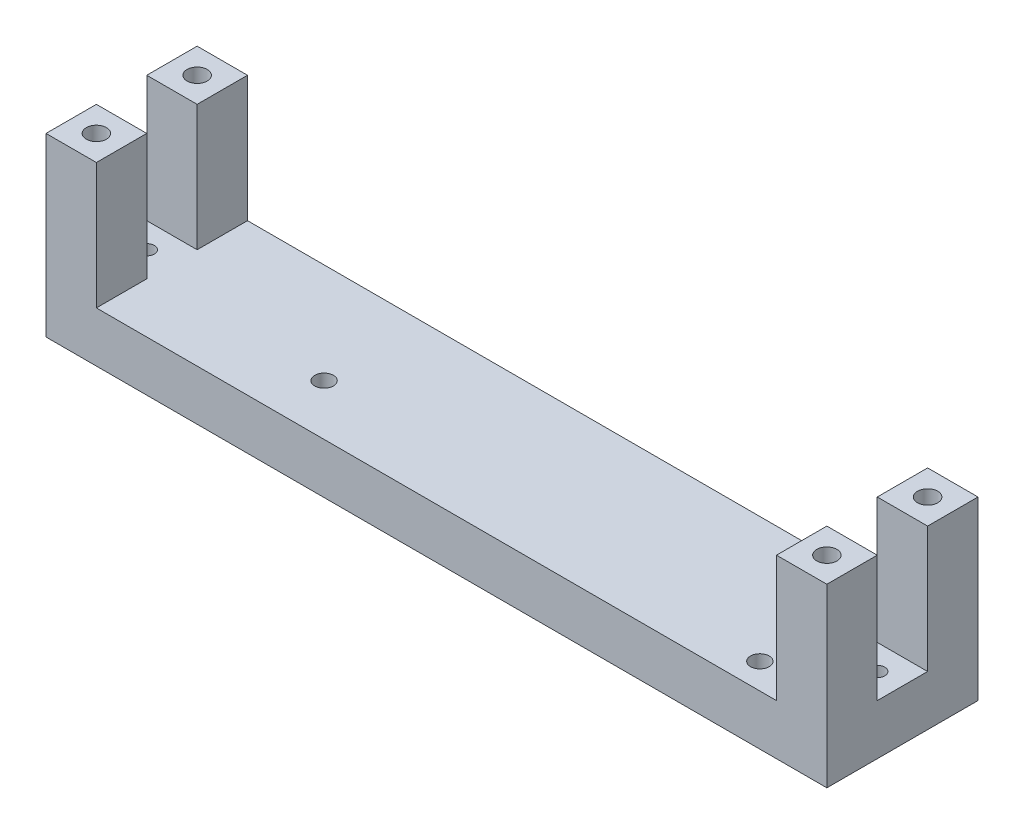
ISO-10303-21;
HEADER;
FILE_DESCRIPTION(('STEP AP214'),'2;1');
FILE_NAME('part.step','',(''),(''),'','','');
FILE_SCHEMA(('AUTOMOTIVE_DESIGN { 1 0 10303 214 1 1 1 1 }'));
ENDSEC;
DATA;
#1=APPLICATION_CONTEXT('core data for automotive mechanical design processes');
#2=APPLICATION_PROTOCOL_DEFINITION('international standard','automotive_design',2000,#1);
#3=PRODUCT_CONTEXT('',#1,'mechanical');
#4=PRODUCT('Part','Part','',(#3));
#5=PRODUCT_RELATED_PRODUCT_CATEGORY('part','',(#4));
#6=PRODUCT_DEFINITION_FORMATION('','',#4);
#7=PRODUCT_DEFINITION_CONTEXT('part definition',#1,'design');
#8=PRODUCT_DEFINITION('design','',#6,#7);
#9=PRODUCT_DEFINITION_SHAPE('','',#8);
#10=(LENGTH_UNIT() NAMED_UNIT(*) SI_UNIT(.MILLI.,.METRE.));
#11=(NAMED_UNIT(*) PLANE_ANGLE_UNIT() SI_UNIT($,.RADIAN.));
#12=(NAMED_UNIT(*) SI_UNIT($,.STERADIAN.) SOLID_ANGLE_UNIT());
#13=UNCERTAINTY_MEASURE_WITH_UNIT(LENGTH_MEASURE(1.E-05),#10,'distance_accuracy_value','');
#14=(GEOMETRIC_REPRESENTATION_CONTEXT(3) GLOBAL_UNCERTAINTY_ASSIGNED_CONTEXT((#13)) GLOBAL_UNIT_ASSIGNED_CONTEXT((#10,
#11,#12)) REPRESENTATION_CONTEXT('',''));
#15=CARTESIAN_POINT('',(0.,0.,0.));
#16=DIRECTION('',(0.,0.,1.));
#17=DIRECTION('',(1.,0.,0.));
#18=AXIS2_PLACEMENT_3D('',#15,#16,#17);
#19=CARTESIAN_POINT('',(0.,10.,0.));
#20=DIRECTION('',(0.,1.,0.));
#21=DIRECTION('',(0.,0.,1.));
#22=AXIS2_PLACEMENT_3D('',#19,#20,#21);
#23=PLANE('',#22);
#24=CARTESIAN_POINT('',(95.6972789115646,10.,-148.962585034014));
#25=DIRECTION('',(0.,1.,0.));
#26=DIRECTION('',(0.,0.,1.));
#27=AXIS2_PLACEMENT_3D('',#24,#25,#26);
#28=CIRCLE('',#27,1.5);
#29=CARTESIAN_POINT('',(95.6972789115646,10.,-147.462585034014));
#30=VERTEX_POINT('',#29);
#31=EDGE_CURVE('E392',#30,#30,#28,.T.);
#32=ORIENTED_EDGE('',*,*,#31,.F.);
#33=EDGE_LOOP('',(#32));
#34=FACE_BOUND('',#33,.T.);
#35=CARTESIAN_POINT('',(82.2972789115646,10.,-139.062585034014));
#36=DIRECTION('',(0.,1.,0.));
#37=DIRECTION('',(0.,0.,1.));
#38=AXIS2_PLACEMENT_3D('',#35,#36,#37);
#39=CIRCLE('',#38,1.85);
#40=CARTESIAN_POINT('',(82.2972789115646,10.,-137.212585034014));
#41=VERTEX_POINT('',#40);
#42=EDGE_CURVE('E386',#41,#41,#39,.T.);
#43=ORIENTED_EDGE('',*,*,#42,.F.);
#44=EDGE_LOOP('',(#43));
#45=FACE_BOUND('',#44,.T.);
#46=CARTESIAN_POINT('',(82.2972789115646,10.,-159.062585034014));
#47=DIRECTION('',(0.,1.,0.));
#48=DIRECTION('',(0.,0.,1.));
#49=AXIS2_PLACEMENT_3D('',#46,#47,#48);
#50=CIRCLE('',#49,1.85);
#51=CARTESIAN_POINT('',(82.2972789115646,10.,-157.212585034014));
#52=VERTEX_POINT('',#51);
#53=EDGE_CURVE('E380',#52,#52,#50,.T.);
#54=ORIENTED_EDGE('',*,*,#53,.F.);
#55=EDGE_LOOP('',(#54));
#56=FACE_BOUND('',#55,.T.);
#57=CARTESIAN_POINT('',(-49.3027210884354,10.,-148.962585034014));
#58=DIRECTION('',(0.,1.,0.));
#59=DIRECTION('',(0.,0.,1.));
#60=AXIS2_PLACEMENT_3D('',#57,#58,#59);
#61=CIRCLE('',#60,1.5);
#62=CARTESIAN_POINT('',(-49.3027210884354,10.,-147.462585034014));
#63=VERTEX_POINT('',#62);
#64=EDGE_CURVE('E374',#63,#63,#61,.T.);
#65=ORIENTED_EDGE('',*,*,#64,.F.);
#66=EDGE_LOOP('',(#65));
#67=FACE_BOUND('',#66,.T.);
#68=CARTESIAN_POINT('',(-9.20272108843541,10.,-144.062585034014));
#69=DIRECTION('',(0.,1.,0.));
#70=DIRECTION('',(0.,0.,1.));
#71=AXIS2_PLACEMENT_3D('',#68,#69,#70);
#72=CIRCLE('',#71,1.84999999999999);
#73=CARTESIAN_POINT('',(-9.20272108843541,10.,-142.212585034014));
#74=VERTEX_POINT('',#73);
#75=EDGE_CURVE('E368',#74,#74,#72,.T.);
#76=ORIENTED_EDGE('',*,*,#75,.F.);
#77=EDGE_LOOP('',(#76));
#78=FACE_BOUND('',#77,.T.);
#79=DIRECTION('',(0.,0.,1.));
#80=VECTOR('',#79,1.);
#81=CARTESIAN_POINT('',(90.6972789115646,10.,-133.962585034014));
#82=LINE('',#81,#80);
#83=CARTESIAN_POINT('',(90.6972789115646,10.,-143.962585034014));
#84=VERTEX_POINT('',#83);
#85=CARTESIAN_POINT('',(90.6972789115646,10.,-133.962585034014));
#86=VERTEX_POINT('',#85);
#87=EDGE_CURVE('E55',#84,#86,#82,.T.);
#88=ORIENTED_EDGE('',*,*,#87,.F.);
#89=DIRECTION('',(-1.,0.,0.));
#90=VECTOR('',#89,1.);
#91=CARTESIAN_POINT('',(100.697278911565,10.,-143.962585034014));
#92=LINE('',#91,#90);
#93=CARTESIAN_POINT('',(100.697278911565,10.,-143.962585034014));
#94=VERTEX_POINT('',#93);
#95=EDGE_CURVE('E340',#94,#84,#92,.T.);
#96=ORIENTED_EDGE('',*,*,#95,.F.);
#97=DIRECTION('',(0.,0.,-1.));
#98=VECTOR('',#97,1.);
#99=CARTESIAN_POINT('',(100.697278911565,10.,-163.962585034014));
#100=LINE('',#99,#98);
#101=CARTESIAN_POINT('',(100.697278911565,10.,-153.962585034014));
#102=VERTEX_POINT('',#101);
#103=EDGE_CURVE('E175',#94,#102,#100,.T.);
#104=ORIENTED_EDGE('',*,*,#103,.T.);
#105=DIRECTION('',(1.,0.,0.));
#106=VECTOR('',#105,1.);
#107=CARTESIAN_POINT('',(100.697278911565,10.,-153.962585034014));
#108=LINE('',#107,#106);
#109=CARTESIAN_POINT('',(90.6972789115646,10.,-153.962585034014));
#110=VERTEX_POINT('',#109);
#111=EDGE_CURVE('E179',#110,#102,#108,.T.);
#112=ORIENTED_EDGE('',*,*,#111,.F.);
#113=DIRECTION('',(0.,0.,1.));
#114=VECTOR('',#113,1.);
#115=CARTESIAN_POINT('',(90.6972789115646,10.,-163.962585034014));
#116=LINE('',#115,#114);
#117=CARTESIAN_POINT('',(90.6972789115646,10.,-163.962585034014));
#118=VERTEX_POINT('',#117);
#119=EDGE_CURVE('E176',#118,#110,#116,.T.);
#120=ORIENTED_EDGE('',*,*,#119,.F.);
#121=DIRECTION('',(-1.,0.,0.));
#122=VECTOR('',#121,1.);
#123=CARTESIAN_POINT('',(-54.3027210884354,10.,-163.962585034014));
#124=LINE('',#123,#122);
#125=CARTESIAN_POINT('',(-44.3027210884354,10.,-163.962585034014));
#126=VERTEX_POINT('',#125);
#127=EDGE_CURVE('E257',#118,#126,#124,.T.);
#128=ORIENTED_EDGE('',*,*,#127,.T.);
#129=DIRECTION('',(0.,0.,-1.));
#130=VECTOR('',#129,1.);
#131=CARTESIAN_POINT('',(-44.3027210884354,10.,-163.962585034014));
#132=LINE('',#131,#130);
#133=CARTESIAN_POINT('',(-44.3027210884354,10.,-153.962585034014));
#134=VERTEX_POINT('',#133);
#135=EDGE_CURVE('E230',#134,#126,#132,.T.);
#136=ORIENTED_EDGE('',*,*,#135,.F.);
#137=DIRECTION('',(1.,0.,0.));
#138=VECTOR('',#137,1.);
#139=CARTESIAN_POINT('',(-54.3027210884354,10.,-153.962585034014));
#140=LINE('',#139,#138);
#141=CARTESIAN_POINT('',(-54.3027210884354,10.,-153.962585034014));
#142=VERTEX_POINT('',#141);
#143=EDGE_CURVE('E225',#142,#134,#140,.T.);
#144=ORIENTED_EDGE('',*,*,#143,.F.);
#145=DIRECTION('',(0.,0.,1.));
#146=VECTOR('',#145,1.);
#147=CARTESIAN_POINT('',(-54.3027210884354,10.,-163.962585034014));
#148=LINE('',#147,#146);
#149=CARTESIAN_POINT('',(-54.3027210884354,10.,-143.962585034014));
#150=VERTEX_POINT('',#149);
#151=EDGE_CURVE('E251',#142,#150,#148,.T.);
#152=ORIENTED_EDGE('',*,*,#151,.T.);
#153=DIRECTION('',(-1.,0.,0.));
#154=VECTOR('',#153,1.);
#155=CARTESIAN_POINT('',(-54.3027210884354,10.,-143.962585034014));
#156=LINE('',#155,#154);
#157=CARTESIAN_POINT('',(-44.3027210884354,10.,-143.962585034014));
#158=VERTEX_POINT('',#157);
#159=EDGE_CURVE('E209',#158,#150,#156,.T.);
#160=ORIENTED_EDGE('',*,*,#159,.F.);
#161=DIRECTION('',(0.,0.,-1.));
#162=VECTOR('',#161,1.);
#163=CARTESIAN_POINT('',(-44.3027210884354,10.,-133.962585034014));
#164=LINE('',#163,#162);
#165=CARTESIAN_POINT('',(-44.3027210884354,10.,-133.962585034014));
#166=VERTEX_POINT('',#165);
#167=EDGE_CURVE('E204',#166,#158,#164,.T.);
#168=ORIENTED_EDGE('',*,*,#167,.F.);
#169=DIRECTION('',(1.,0.,0.));
#170=VECTOR('',#169,1.);
#171=CARTESIAN_POINT('',(-54.3027210884354,10.,-133.962585034014));
#172=LINE('',#171,#170);
#173=EDGE_CURVE('E60',#166,#86,#172,.T.);
#174=ORIENTED_EDGE('',*,*,#173,.T.);
#175=EDGE_LOOP('',(#88,#96,#104,#112,#120,#128,#136,#144,#152,#160,#168,#174));
#176=FACE_BOUND('',#175,.T.);
#177=ADVANCED_FACE('F40',(#34,#45,#56,#67,#78,#176),#23,.T.);
#178=CARTESIAN_POINT('',(-54.3027210884354,10.,-163.962585034014));
#179=DIRECTION('',(1.,0.,0.));
#180=DIRECTION('',(0.,0.,-1.));
#181=AXIS2_PLACEMENT_3D('',#178,#179,#180);
#182=PLANE('',#181);
#183=DIRECTION('',(0.,0.,1.));
#184=VECTOR('',#183,1.);
#185=CARTESIAN_POINT('',(-54.3027210884354,0.,-163.962585034014));
#186=LINE('',#185,#184);
#187=CARTESIAN_POINT('',(-54.3027210884354,0.,-163.962585034014));
#188=VERTEX_POINT('',#187);
#189=CARTESIAN_POINT('',(-54.3027210884354,0.,-133.962585034014));
#190=VERTEX_POINT('',#189);
#191=EDGE_CURVE('E250',#188,#190,#186,.T.);
#192=ORIENTED_EDGE('',*,*,#191,.T.);
#193=DIRECTION('',(0.,-1.,0.));
#194=VECTOR('',#193,1.);
#195=CARTESIAN_POINT('',(-54.3027210884354,10.,-133.962585034014));
#196=LINE('',#195,#194);
#197=CARTESIAN_POINT('',(-54.3027210884354,35.,-133.962585034014));
#198=VERTEX_POINT('',#197);
#199=EDGE_CURVE('E11',#198,#190,#196,.T.);
#200=ORIENTED_EDGE('',*,*,#199,.F.);
#201=DIRECTION('',(0.,0.,1.));
#202=VECTOR('',#201,1.);
#203=CARTESIAN_POINT('',(-54.3027210884354,35.,-133.962585034014));
#204=LINE('',#203,#202);
#205=CARTESIAN_POINT('',(-54.3027210884354,35.,-143.962585034014));
#206=VERTEX_POINT('',#205);
#207=EDGE_CURVE('E205',#206,#198,#204,.T.);
#208=ORIENTED_EDGE('',*,*,#207,.F.);
#209=DIRECTION('',(0.,-1.,0.));
#210=VECTOR('',#209,1.);
#211=CARTESIAN_POINT('',(-54.3027210884354,35.,-143.962585034014));
#212=LINE('',#211,#210);
#213=EDGE_CURVE('E215',#206,#150,#212,.T.);
#214=ORIENTED_EDGE('',*,*,#213,.T.);
#215=ORIENTED_EDGE('',*,*,#151,.F.);
#216=DIRECTION('',(0.,-1.,0.));
#217=VECTOR('',#216,1.);
#218=CARTESIAN_POINT('',(-54.3027210884354,35.,-153.962585034014));
#219=LINE('',#218,#217);
#220=CARTESIAN_POINT('',(-54.3027210884354,35.,-153.962585034014));
#221=VERTEX_POINT('',#220);
#222=EDGE_CURVE('E247',#221,#142,#219,.T.);
#223=ORIENTED_EDGE('',*,*,#222,.F.);
#224=DIRECTION('',(0.,0.,1.));
#225=VECTOR('',#224,1.);
#226=CARTESIAN_POINT('',(-54.3027210884354,35.,-163.962585034014));
#227=LINE('',#226,#225);
#228=CARTESIAN_POINT('',(-54.3027210884354,35.,-163.962585034014));
#229=VERTEX_POINT('',#228);
#230=EDGE_CURVE('E226',#229,#221,#227,.T.);
#231=ORIENTED_EDGE('',*,*,#230,.F.);
#232=DIRECTION('',(0.,-1.,0.));
#233=VECTOR('',#232,1.);
#234=CARTESIAN_POINT('',(-54.3027210884354,10.,-163.962585034014));
#235=LINE('',#234,#233);
#236=EDGE_CURVE('E259',#229,#188,#235,.T.);
#237=ORIENTED_EDGE('',*,*,#236,.T.);
#238=EDGE_LOOP('',(#192,#200,#208,#214,#215,#223,#231,#237));
#239=FACE_BOUND('',#238,.T.);
#240=ADVANCED_FACE('F42',(#239),#182,.F.);
#241=CARTESIAN_POINT('',(-54.3027210884354,10.,-133.962585034014));
#242=DIRECTION('',(0.,0.,-1.));
#243=DIRECTION('',(-1.,0.,0.));
#244=AXIS2_PLACEMENT_3D('',#241,#242,#243);
#245=PLANE('',#244);
#246=DIRECTION('',(1.,0.,0.));
#247=VECTOR('',#246,1.);
#248=CARTESIAN_POINT('',(-54.3027210884354,0.,-133.962585034014));
#249=LINE('',#248,#247);
#250=CARTESIAN_POINT('',(100.697278911565,0.,-133.962585034014));
#251=VERTEX_POINT('',#250);
#252=EDGE_CURVE('E262',#190,#251,#249,.T.);
#253=ORIENTED_EDGE('',*,*,#252,.T.);
#254=DIRECTION('',(0.,-1.,0.));
#255=VECTOR('',#254,1.);
#256=CARTESIAN_POINT('',(100.697278911565,10.,-133.962585034014));
#257=LINE('',#256,#255);
#258=CARTESIAN_POINT('',(100.697278911565,35.,-133.962585034014));
#259=VERTEX_POINT('',#258);
#260=EDGE_CURVE('E48',#259,#251,#257,.T.);
#261=ORIENTED_EDGE('',*,*,#260,.F.);
#262=DIRECTION('',(1.,0.,0.));
#263=VECTOR('',#262,1.);
#264=CARTESIAN_POINT('',(100.697278911565,35.,-133.962585034014));
#265=LINE('',#264,#263);
#266=CARTESIAN_POINT('',(90.6972789115646,35.,-133.962585034014));
#267=VERTEX_POINT('',#266);
#268=EDGE_CURVE('E169',#267,#259,#265,.T.);
#269=ORIENTED_EDGE('',*,*,#268,.F.);
#270=DIRECTION('',(0.,-1.,0.));
#271=VECTOR('',#270,1.);
#272=CARTESIAN_POINT('',(90.6972789115646,35.,-133.962585034014));
#273=LINE('',#272,#271);
#274=EDGE_CURVE('E181',#267,#86,#273,.T.);
#275=ORIENTED_EDGE('',*,*,#274,.T.);
#276=ORIENTED_EDGE('',*,*,#173,.F.);
#277=DIRECTION('',(0.,-1.,0.));
#278=VECTOR('',#277,1.);
#279=CARTESIAN_POINT('',(-44.3027210884354,35.,-133.962585034014));
#280=LINE('',#279,#278);
#281=CARTESIAN_POINT('',(-44.3027210884354,35.,-133.962585034014));
#282=VERTEX_POINT('',#281);
#283=EDGE_CURVE('E223',#282,#166,#280,.T.);
#284=ORIENTED_EDGE('',*,*,#283,.F.);
#285=DIRECTION('',(1.,0.,0.));
#286=VECTOR('',#285,1.);
#287=CARTESIAN_POINT('',(-54.3027210884354,35.,-133.962585034014));
#288=LINE('',#287,#286);
#289=EDGE_CURVE('E208',#198,#282,#288,.T.);
#290=ORIENTED_EDGE('',*,*,#289,.F.);
#291=ORIENTED_EDGE('',*,*,#199,.T.);
#292=EDGE_LOOP('',(#253,#261,#269,#275,#276,#284,#290,#291));
#293=FACE_BOUND('',#292,.T.);
#294=ADVANCED_FACE('F311',(#293),#245,.F.);
#295=CARTESIAN_POINT('',(100.697278911565,10.,-163.962585034014));
#296=DIRECTION('',(-1.,0.,0.));
#297=DIRECTION('',(0.,0.,1.));
#298=AXIS2_PLACEMENT_3D('',#295,#296,#297);
#299=PLANE('',#298);
#300=DIRECTION('',(0.,0.,-1.));
#301=VECTOR('',#300,1.);
#302=CARTESIAN_POINT('',(100.697278911565,0.,-163.962585034014));
#303=LINE('',#302,#301);
#304=CARTESIAN_POINT('',(100.697278911565,0.,-163.962585034014));
#305=VERTEX_POINT('',#304);
#306=EDGE_CURVE('E264',#251,#305,#303,.T.);
#307=ORIENTED_EDGE('',*,*,#306,.T.);
#308=DIRECTION('',(0.,-1.,0.));
#309=VECTOR('',#308,1.);
#310=CARTESIAN_POINT('',(100.697278911565,10.,-163.962585034014));
#311=LINE('',#310,#309);
#312=CARTESIAN_POINT('',(100.697278911565,35.,-163.962585034014));
#313=VERTEX_POINT('',#312);
#314=EDGE_CURVE('E269',#313,#305,#311,.T.);
#315=ORIENTED_EDGE('',*,*,#314,.F.);
#316=DIRECTION('',(0.,0.,-1.));
#317=VECTOR('',#316,1.);
#318=CARTESIAN_POINT('',(100.697278911565,35.,-163.962585034014));
#319=LINE('',#318,#317);
#320=CARTESIAN_POINT('',(100.697278911565,35.,-153.962585034014));
#321=VERTEX_POINT('',#320);
#322=EDGE_CURVE('E185',#321,#313,#319,.T.);
#323=ORIENTED_EDGE('',*,*,#322,.F.);
#324=DIRECTION('',(0.,-1.,0.));
#325=VECTOR('',#324,1.);
#326=CARTESIAN_POINT('',(100.697278911565,35.,-153.962585034014));
#327=LINE('',#326,#325);
#328=EDGE_CURVE('E193',#321,#102,#327,.T.);
#329=ORIENTED_EDGE('',*,*,#328,.T.);
#330=ORIENTED_EDGE('',*,*,#103,.F.);
#331=DIRECTION('',(0.,-1.,0.));
#332=VECTOR('',#331,1.);
#333=CARTESIAN_POINT('',(100.697278911565,35.,-143.962585034014));
#334=LINE('',#333,#332);
#335=CARTESIAN_POINT('',(100.697278911565,35.,-143.962585034014));
#336=VERTEX_POINT('',#335);
#337=EDGE_CURVE('E157',#336,#94,#334,.T.);
#338=ORIENTED_EDGE('',*,*,#337,.F.);
#339=DIRECTION('',(0.,0.,-1.));
#340=VECTOR('',#339,1.);
#341=CARTESIAN_POINT('',(100.697278911565,35.,-133.962585034014));
#342=LINE('',#341,#340);
#343=EDGE_CURVE('E163',#259,#336,#342,.T.);
#344=ORIENTED_EDGE('',*,*,#343,.F.);
#345=ORIENTED_EDGE('',*,*,#260,.T.);
#346=EDGE_LOOP('',(#307,#315,#323,#329,#330,#338,#344,#345));
#347=FACE_BOUND('',#346,.T.);
#348=ADVANCED_FACE('F173',(#347),#299,.F.);
#349=CARTESIAN_POINT('',(-54.3027210884354,10.,-163.962585034014));
#350=DIRECTION('',(0.,0.,1.));
#351=DIRECTION('',(1.,0.,0.));
#352=AXIS2_PLACEMENT_3D('',#349,#350,#351);
#353=PLANE('',#352);
#354=DIRECTION('',(-1.,0.,0.));
#355=VECTOR('',#354,1.);
#356=CARTESIAN_POINT('',(-54.3027210884354,0.,-163.962585034014));
#357=LINE('',#356,#355);
#358=EDGE_CURVE('E254',#305,#188,#357,.T.);
#359=ORIENTED_EDGE('',*,*,#358,.T.);
#360=ORIENTED_EDGE('',*,*,#236,.F.);
#361=DIRECTION('',(-1.,0.,0.));
#362=VECTOR('',#361,1.);
#363=CARTESIAN_POINT('',(-54.3027210884354,35.,-163.962585034014));
#364=LINE('',#363,#362);
#365=CARTESIAN_POINT('',(-44.3027210884354,35.,-163.962585034014));
#366=VERTEX_POINT('',#365);
#367=EDGE_CURVE('E234',#366,#229,#364,.T.);
#368=ORIENTED_EDGE('',*,*,#367,.F.);
#369=DIRECTION('',(0.,-1.,0.));
#370=VECTOR('',#369,1.);
#371=CARTESIAN_POINT('',(-44.3027210884354,35.,-163.962585034014));
#372=LINE('',#371,#370);
#373=EDGE_CURVE('E237',#366,#126,#372,.T.);
#374=ORIENTED_EDGE('',*,*,#373,.T.);
#375=ORIENTED_EDGE('',*,*,#127,.F.);
#376=DIRECTION('',(0.,-1.,0.));
#377=VECTOR('',#376,1.);
#378=CARTESIAN_POINT('',(90.6972789115646,35.,-163.962585034014));
#379=LINE('',#378,#377);
#380=CARTESIAN_POINT('',(90.6972789115646,35.,-163.962585034014));
#381=VERTEX_POINT('',#380);
#382=EDGE_CURVE('E201',#381,#118,#379,.T.);
#383=ORIENTED_EDGE('',*,*,#382,.F.);
#384=DIRECTION('',(-1.,0.,0.));
#385=VECTOR('',#384,1.);
#386=CARTESIAN_POINT('',(100.697278911565,35.,-163.962585034014));
#387=LINE('',#386,#385);
#388=EDGE_CURVE('E188',#313,#381,#387,.T.);
#389=ORIENTED_EDGE('',*,*,#388,.F.);
#390=ORIENTED_EDGE('',*,*,#314,.T.);
#391=EDGE_LOOP('',(#359,#360,#368,#374,#375,#383,#389,#390));
#392=FACE_BOUND('',#391,.T.);
#393=ADVANCED_FACE('F278',(#392),#353,.F.);
#394=CARTESIAN_POINT('',(0.,0.,0.));
#395=DIRECTION('',(0.,1.,0.));
#396=DIRECTION('',(0.,0.,1.));
#397=AXIS2_PLACEMENT_3D('',#394,#395,#396);
#398=PLANE('',#397);
#399=CARTESIAN_POINT('',(95.6972789115646,0.,-148.962585034014));
#400=DIRECTION('',(0.,1.,0.));
#401=DIRECTION('',(0.,0.,1.));
#402=AXIS2_PLACEMENT_3D('',#399,#400,#401);
#403=CIRCLE('',#402,1.5);
#404=CARTESIAN_POINT('',(95.6972789115646,0.,-147.462585034014));
#405=VERTEX_POINT('',#404);
#406=EDGE_CURVE('E365',#405,#405,#403,.T.);
#407=ORIENTED_EDGE('',*,*,#406,.T.);
#408=EDGE_LOOP('',(#407));
#409=FACE_BOUND('',#408,.T.);
#410=CARTESIAN_POINT('',(82.2972789115646,0.,-139.062585034014));
#411=DIRECTION('',(0.,1.,0.));
#412=DIRECTION('',(0.,0.,1.));
#413=AXIS2_PLACEMENT_3D('',#410,#411,#412);
#414=CIRCLE('',#413,1.85);
#415=CARTESIAN_POINT('',(82.2972789115646,0.,-137.212585034014));
#416=VERTEX_POINT('',#415);
#417=EDGE_CURVE('E389',#416,#416,#414,.T.);
#418=ORIENTED_EDGE('',*,*,#417,.T.);
#419=EDGE_LOOP('',(#418));
#420=FACE_BOUND('',#419,.T.);
#421=CARTESIAN_POINT('',(82.2972789115646,0.,-159.062585034014));
#422=DIRECTION('',(0.,1.,0.));
#423=DIRECTION('',(0.,0.,1.));
#424=AXIS2_PLACEMENT_3D('',#421,#422,#423);
#425=CIRCLE('',#424,1.85);
#426=CARTESIAN_POINT('',(82.2972789115646,0.,-157.212585034014));
#427=VERTEX_POINT('',#426);
#428=EDGE_CURVE('E383',#427,#427,#425,.T.);
#429=ORIENTED_EDGE('',*,*,#428,.T.);
#430=EDGE_LOOP('',(#429));
#431=FACE_BOUND('',#430,.T.);
#432=CARTESIAN_POINT('',(-49.3027210884354,0.,-148.962585034014));
#433=DIRECTION('',(0.,1.,0.));
#434=DIRECTION('',(0.,0.,1.));
#435=AXIS2_PLACEMENT_3D('',#432,#433,#434);
#436=CIRCLE('',#435,1.5);
#437=CARTESIAN_POINT('',(-49.3027210884354,0.,-147.462585034014));
#438=VERTEX_POINT('',#437);
#439=EDGE_CURVE('E377',#438,#438,#436,.T.);
#440=ORIENTED_EDGE('',*,*,#439,.T.);
#441=EDGE_LOOP('',(#440));
#442=FACE_BOUND('',#441,.T.);
#443=CARTESIAN_POINT('',(-9.20272108843541,0.,-144.062585034014));
#444=DIRECTION('',(0.,1.,0.));
#445=DIRECTION('',(0.,0.,1.));
#446=AXIS2_PLACEMENT_3D('',#443,#444,#445);
#447=CIRCLE('',#446,1.84999999999999);
#448=CARTESIAN_POINT('',(-9.20272108843541,0.,-142.212585034014));
#449=VERTEX_POINT('',#448);
#450=EDGE_CURVE('E371',#449,#449,#447,.T.);
#451=ORIENTED_EDGE('',*,*,#450,.T.);
#452=EDGE_LOOP('',(#451));
#453=FACE_BOUND('',#452,.T.);
#454=ORIENTED_EDGE('',*,*,#191,.F.);
#455=ORIENTED_EDGE('',*,*,#358,.F.);
#456=ORIENTED_EDGE('',*,*,#306,.F.);
#457=ORIENTED_EDGE('',*,*,#252,.F.);
#458=EDGE_LOOP('',(#454,#455,#456,#457));
#459=FACE_BOUND('',#458,.T.);
#460=ADVANCED_FACE('F276',(#409,#420,#431,#442,#453,#459),#398,.F.);
#461=CARTESIAN_POINT('',(-54.3027210884354,35.,-153.962585034014));
#462=DIRECTION('',(0.,0.,-1.));
#463=DIRECTION('',(-1.,0.,0.));
#464=AXIS2_PLACEMENT_3D('',#461,#462,#463);
#465=PLANE('',#464);
#466=ORIENTED_EDGE('',*,*,#143,.T.);
#467=DIRECTION('',(0.,-1.,0.));
#468=VECTOR('',#467,1.);
#469=CARTESIAN_POINT('',(-44.3027210884354,35.,-153.962585034014));
#470=LINE('',#469,#468);
#471=CARTESIAN_POINT('',(-44.3027210884354,35.,-153.962585034014));
#472=VERTEX_POINT('',#471);
#473=EDGE_CURVE('E244',#472,#134,#470,.T.);
#474=ORIENTED_EDGE('',*,*,#473,.F.);
#475=DIRECTION('',(1.,0.,0.));
#476=VECTOR('',#475,1.);
#477=CARTESIAN_POINT('',(-54.3027210884354,35.,-153.962585034014));
#478=LINE('',#477,#476);
#479=EDGE_CURVE('E229',#221,#472,#478,.T.);
#480=ORIENTED_EDGE('',*,*,#479,.F.);
#481=ORIENTED_EDGE('',*,*,#222,.T.);
#482=EDGE_LOOP('',(#466,#474,#480,#481));
#483=FACE_BOUND('',#482,.T.);
#484=ADVANCED_FACE('F295',(#483),#465,.F.);
#485=CARTESIAN_POINT('',(-44.3027210884354,35.,-163.962585034014));
#486=DIRECTION('',(-1.,0.,0.));
#487=DIRECTION('',(0.,0.,1.));
#488=AXIS2_PLACEMENT_3D('',#485,#486,#487);
#489=PLANE('',#488);
#490=ORIENTED_EDGE('',*,*,#135,.T.);
#491=ORIENTED_EDGE('',*,*,#373,.F.);
#492=DIRECTION('',(0.,0.,-1.));
#493=VECTOR('',#492,1.);
#494=CARTESIAN_POINT('',(-44.3027210884354,35.,-163.962585034014));
#495=LINE('',#494,#493);
#496=EDGE_CURVE('E232',#472,#366,#495,.T.);
#497=ORIENTED_EDGE('',*,*,#496,.F.);
#498=ORIENTED_EDGE('',*,*,#473,.T.);
#499=EDGE_LOOP('',(#490,#491,#497,#498));
#500=FACE_BOUND('',#499,.T.);
#501=ADVANCED_FACE('F293',(#500),#489,.F.);
#502=CARTESIAN_POINT('',(0.,35.,0.));
#503=DIRECTION('',(0.,1.,0.));
#504=DIRECTION('',(0.,0.,1.));
#505=AXIS2_PLACEMENT_3D('',#502,#503,#504);
#506=PLANE('',#505);
#507=CARTESIAN_POINT('',(-49.3027210884354,35.,-158.962585034014));
#508=DIRECTION('',(0.,1.,0.));
#509=DIRECTION('',(0.,0.,1.));
#510=AXIS2_PLACEMENT_3D('',#507,#508,#509);
#511=CIRCLE('',#510,2.);
#512=CARTESIAN_POINT('',(-49.3027210884354,35.,-156.962585034014));
#513=VERTEX_POINT('',#512);
#514=EDGE_CURVE('E362',#513,#513,#511,.T.);
#515=ORIENTED_EDGE('',*,*,#514,.F.);
#516=EDGE_LOOP('',(#515));
#517=FACE_BOUND('',#516,.T.);
#518=ORIENTED_EDGE('',*,*,#230,.T.);
#519=ORIENTED_EDGE('',*,*,#479,.T.);
#520=ORIENTED_EDGE('',*,*,#496,.T.);
#521=ORIENTED_EDGE('',*,*,#367,.T.);
#522=EDGE_LOOP('',(#518,#519,#520,#521));
#523=FACE_BOUND('',#522,.T.);
#524=ADVANCED_FACE('F286',(#517,#523),#506,.T.);
#525=CARTESIAN_POINT('',(-44.3027210884354,35.,-133.962585034014));
#526=DIRECTION('',(-1.,0.,0.));
#527=DIRECTION('',(0.,0.,1.));
#528=AXIS2_PLACEMENT_3D('',#525,#526,#527);
#529=PLANE('',#528);
#530=ORIENTED_EDGE('',*,*,#167,.T.);
#531=DIRECTION('',(0.,-1.,0.));
#532=VECTOR('',#531,1.);
#533=CARTESIAN_POINT('',(-44.3027210884354,35.,-143.962585034014));
#534=LINE('',#533,#532);
#535=CARTESIAN_POINT('',(-44.3027210884354,35.,-143.962585034014));
#536=VERTEX_POINT('',#535);
#537=EDGE_CURVE('E221',#536,#158,#534,.T.);
#538=ORIENTED_EDGE('',*,*,#537,.F.);
#539=DIRECTION('',(0.,0.,-1.));
#540=VECTOR('',#539,1.);
#541=CARTESIAN_POINT('',(-44.3027210884354,35.,-133.962585034014));
#542=LINE('',#541,#540);
#543=EDGE_CURVE('E211',#282,#536,#542,.T.);
#544=ORIENTED_EDGE('',*,*,#543,.F.);
#545=ORIENTED_EDGE('',*,*,#283,.T.);
#546=EDGE_LOOP('',(#530,#538,#544,#545));
#547=FACE_BOUND('',#546,.T.);
#548=ADVANCED_FACE('F479',(#547),#529,.F.);
#549=CARTESIAN_POINT('',(-54.3027210884354,35.,-143.962585034014));
#550=DIRECTION('',(0.,0.,1.));
#551=DIRECTION('',(1.,0.,0.));
#552=AXIS2_PLACEMENT_3D('',#549,#550,#551);
#553=PLANE('',#552);
#554=ORIENTED_EDGE('',*,*,#159,.T.);
#555=ORIENTED_EDGE('',*,*,#213,.F.);
#556=DIRECTION('',(-1.,0.,0.));
#557=VECTOR('',#556,1.);
#558=CARTESIAN_POINT('',(-54.3027210884354,35.,-143.962585034014));
#559=LINE('',#558,#557);
#560=EDGE_CURVE('E213',#536,#206,#559,.T.);
#561=ORIENTED_EDGE('',*,*,#560,.F.);
#562=ORIENTED_EDGE('',*,*,#537,.T.);
#563=EDGE_LOOP('',(#554,#555,#561,#562));
#564=FACE_BOUND('',#563,.T.);
#565=ADVANCED_FACE('F331',(#564),#553,.F.);
#566=CARTESIAN_POINT('',(0.,35.,0.));
#567=DIRECTION('',(0.,-1.,0.));
#568=DIRECTION('',(0.,0.,-1.));
#569=AXIS2_PLACEMENT_3D('',#566,#567,#568);
#570=PLANE('',#569);
#571=CARTESIAN_POINT('',(-49.3027210884354,35.,-138.962585034014));
#572=DIRECTION('',(0.,1.,0.));
#573=DIRECTION('',(0.,0.,1.));
#574=AXIS2_PLACEMENT_3D('',#571,#572,#573);
#575=CIRCLE('',#574,2.);
#576=CARTESIAN_POINT('',(-49.3027210884354,35.,-136.962585034014));
#577=VERTEX_POINT('',#576);
#578=EDGE_CURVE('E350',#577,#577,#575,.T.);
#579=ORIENTED_EDGE('',*,*,#578,.F.);
#580=EDGE_LOOP('',(#579));
#581=FACE_BOUND('',#580,.T.);
#582=ORIENTED_EDGE('',*,*,#207,.T.);
#583=ORIENTED_EDGE('',*,*,#289,.T.);
#584=ORIENTED_EDGE('',*,*,#543,.T.);
#585=ORIENTED_EDGE('',*,*,#560,.T.);
#586=EDGE_LOOP('',(#582,#583,#584,#585));
#587=FACE_BOUND('',#586,.T.);
#588=ADVANCED_FACE('F326',(#581,#587),#570,.F.);
#589=CARTESIAN_POINT('',(90.6972789115646,35.,-163.962585034014));
#590=DIRECTION('',(1.,0.,0.));
#591=DIRECTION('',(0.,0.,-1.));
#592=AXIS2_PLACEMENT_3D('',#589,#590,#591);
#593=PLANE('',#592);
#594=ORIENTED_EDGE('',*,*,#119,.T.);
#595=DIRECTION('',(0.,-1.,0.));
#596=VECTOR('',#595,1.);
#597=CARTESIAN_POINT('',(90.6972789115646,35.,-153.962585034014));
#598=LINE('',#597,#596);
#599=CARTESIAN_POINT('',(90.6972789115646,35.,-153.962585034014));
#600=VERTEX_POINT('',#599);
#601=EDGE_CURVE('E198',#600,#110,#598,.T.);
#602=ORIENTED_EDGE('',*,*,#601,.F.);
#603=DIRECTION('',(0.,0.,1.));
#604=VECTOR('',#603,1.);
#605=CARTESIAN_POINT('',(90.6972789115646,35.,-163.962585034014));
#606=LINE('',#605,#604);
#607=EDGE_CURVE('E190',#381,#600,#606,.T.);
#608=ORIENTED_EDGE('',*,*,#607,.F.);
#609=ORIENTED_EDGE('',*,*,#382,.T.);
#610=EDGE_LOOP('',(#594,#602,#608,#609));
#611=FACE_BOUND('',#610,.T.);
#612=ADVANCED_FACE('F469',(#611),#593,.F.);
#613=CARTESIAN_POINT('',(100.697278911565,35.,-153.962585034014));
#614=DIRECTION('',(0.,0.,-1.));
#615=DIRECTION('',(-1.,0.,0.));
#616=AXIS2_PLACEMENT_3D('',#613,#614,#615);
#617=PLANE('',#616);
#618=ORIENTED_EDGE('',*,*,#111,.T.);
#619=ORIENTED_EDGE('',*,*,#328,.F.);
#620=DIRECTION('',(1.,0.,0.));
#621=VECTOR('',#620,1.);
#622=CARTESIAN_POINT('',(100.697278911565,35.,-153.962585034014));
#623=LINE('',#622,#621);
#624=EDGE_CURVE('E192',#600,#321,#623,.T.);
#625=ORIENTED_EDGE('',*,*,#624,.F.);
#626=ORIENTED_EDGE('',*,*,#601,.T.);
#627=EDGE_LOOP('',(#618,#619,#625,#626));
#628=FACE_BOUND('',#627,.T.);
#629=ADVANCED_FACE('F465',(#628),#617,.F.);
#630=CARTESIAN_POINT('',(0.,35.,0.));
#631=DIRECTION('',(0.,-1.,0.));
#632=DIRECTION('',(0.,0.,-1.));
#633=AXIS2_PLACEMENT_3D('',#630,#631,#632);
#634=PLANE('',#633);
#635=CARTESIAN_POINT('',(95.6972789115646,35.,-158.962585034014));
#636=DIRECTION('',(0.,1.,0.));
#637=DIRECTION('',(0.,0.,1.));
#638=AXIS2_PLACEMENT_3D('',#635,#636,#637);
#639=CIRCLE('',#638,2.);
#640=CARTESIAN_POINT('',(95.6972789115646,35.,-156.962585034014));
#641=VERTEX_POINT('',#640);
#642=EDGE_CURVE('E357',#641,#641,#639,.T.);
#643=ORIENTED_EDGE('',*,*,#642,.F.);
#644=EDGE_LOOP('',(#643));
#645=FACE_BOUND('',#644,.T.);
#646=ORIENTED_EDGE('',*,*,#322,.T.);
#647=ORIENTED_EDGE('',*,*,#388,.T.);
#648=ORIENTED_EDGE('',*,*,#607,.T.);
#649=ORIENTED_EDGE('',*,*,#624,.T.);
#650=EDGE_LOOP('',(#646,#647,#648,#649));
#651=FACE_BOUND('',#650,.T.);
#652=ADVANCED_FACE('F462',(#645,#651),#634,.F.);
#653=CARTESIAN_POINT('',(100.697278911565,35.,-143.962585034014));
#654=DIRECTION('',(0.,0.,1.));
#655=DIRECTION('',(1.,0.,0.));
#656=AXIS2_PLACEMENT_3D('',#653,#654,#655);
#657=PLANE('',#656);
#658=ORIENTED_EDGE('',*,*,#95,.T.);
#659=DIRECTION('',(0.,-1.,0.));
#660=VECTOR('',#659,1.);
#661=CARTESIAN_POINT('',(90.6972789115646,35.,-143.962585034014));
#662=LINE('',#661,#660);
#663=CARTESIAN_POINT('',(90.6972789115646,35.,-143.962585034014));
#664=VERTEX_POINT('',#663);
#665=EDGE_CURVE('E159',#664,#84,#662,.T.);
#666=ORIENTED_EDGE('',*,*,#665,.F.);
#667=DIRECTION('',(-1.,0.,0.));
#668=VECTOR('',#667,1.);
#669=CARTESIAN_POINT('',(100.697278911565,35.,-143.962585034014));
#670=LINE('',#669,#668);
#671=EDGE_CURVE('E153',#336,#664,#670,.T.);
#672=ORIENTED_EDGE('',*,*,#671,.F.);
#673=ORIENTED_EDGE('',*,*,#337,.T.);
#674=EDGE_LOOP('',(#658,#666,#672,#673));
#675=FACE_BOUND('',#674,.T.);
#676=ADVANCED_FACE('F155',(#675),#657,.F.);
#677=CARTESIAN_POINT('',(90.6972789115646,35.,-133.962585034014));
#678=DIRECTION('',(1.,0.,0.));
#679=DIRECTION('',(0.,0.,-1.));
#680=AXIS2_PLACEMENT_3D('',#677,#678,#679);
#681=PLANE('',#680);
#682=ORIENTED_EDGE('',*,*,#87,.T.);
#683=ORIENTED_EDGE('',*,*,#274,.F.);
#684=DIRECTION('',(0.,0.,1.));
#685=VECTOR('',#684,1.);
#686=CARTESIAN_POINT('',(90.6972789115646,35.,-133.962585034014));
#687=LINE('',#686,#685);
#688=EDGE_CURVE('E162',#664,#267,#687,.T.);
#689=ORIENTED_EDGE('',*,*,#688,.F.);
#690=ORIENTED_EDGE('',*,*,#665,.T.);
#691=EDGE_LOOP('',(#682,#683,#689,#690));
#692=FACE_BOUND('',#691,.T.);
#693=ADVANCED_FACE('F456',(#692),#681,.F.);
#694=CARTESIAN_POINT('',(0.,35.,0.));
#695=DIRECTION('',(0.,1.,0.));
#696=DIRECTION('',(0.,0.,1.));
#697=AXIS2_PLACEMENT_3D('',#694,#695,#696);
#698=PLANE('',#697);
#699=CARTESIAN_POINT('',(95.6972789115646,35.,-138.962585034014));
#700=DIRECTION('',(0.,1.,0.));
#701=DIRECTION('',(0.,0.,1.));
#702=AXIS2_PLACEMENT_3D('',#699,#700,#701);
#703=CIRCLE('',#702,2.);
#704=CARTESIAN_POINT('',(95.6972789115646,35.,-136.962585034014));
#705=VERTEX_POINT('',#704);
#706=EDGE_CURVE('E344',#705,#705,#703,.T.);
#707=ORIENTED_EDGE('',*,*,#706,.F.);
#708=EDGE_LOOP('',(#707));
#709=FACE_BOUND('',#708,.T.);
#710=ORIENTED_EDGE('',*,*,#343,.T.);
#711=ORIENTED_EDGE('',*,*,#671,.T.);
#712=ORIENTED_EDGE('',*,*,#688,.T.);
#713=ORIENTED_EDGE('',*,*,#268,.T.);
#714=EDGE_LOOP('',(#710,#711,#712,#713));
#715=FACE_BOUND('',#714,.T.);
#716=ADVANCED_FACE('F167',(#709,#715),#698,.T.);
#717=CARTESIAN_POINT('',(95.6972789115646,25.,-138.962585034014));
#718=DIRECTION('',(0.,1.,0.));
#719=DIRECTION('',(0.,0.,1.));
#720=AXIS2_PLACEMENT_3D('',#717,#718,#719);
#721=CYLINDRICAL_SURFACE('',#720,2.);
#722=CARTESIAN_POINT('',(95.6972789115646,25.,-138.962585034014));
#723=DIRECTION('',(0.,1.,0.));
#724=DIRECTION('',(0.,0.,1.));
#725=AXIS2_PLACEMENT_3D('',#722,#723,#724);
#726=CIRCLE('',#725,2.);
#727=CARTESIAN_POINT('',(95.6972789115646,25.,-136.962585034014));
#728=VERTEX_POINT('',#727);
#729=EDGE_CURVE('E341',#728,#728,#726,.T.);
#730=ORIENTED_EDGE('',*,*,#729,.F.);
#731=EDGE_LOOP('',(#730));
#732=FACE_BOUND('',#731,.T.);
#733=ORIENTED_EDGE('',*,*,#706,.T.);
#734=EDGE_LOOP('',(#733));
#735=FACE_BOUND('',#734,.T.);
#736=ADVANCED_FACE('F449',(#732,#735),#721,.F.);
#737=CARTESIAN_POINT('',(95.6972789115646,25.,-138.962585034014));
#738=DIRECTION('',(0.,1.,0.));
#739=DIRECTION('',(0.,0.,1.));
#740=AXIS2_PLACEMENT_3D('',#737,#738,#739);
#741=PLANE('',#740);
#742=ORIENTED_EDGE('',*,*,#729,.T.);
#743=EDGE_LOOP('',(#742));
#744=FACE_BOUND('',#743,.T.);
#745=ADVANCED_FACE('F439',(#744),#741,.T.);
#746=CARTESIAN_POINT('',(95.6972789115646,25.,-158.962585034014));
#747=DIRECTION('',(0.,1.,0.));
#748=DIRECTION('',(0.,0.,1.));
#749=AXIS2_PLACEMENT_3D('',#746,#747,#748);
#750=CYLINDRICAL_SURFACE('',#749,2.);
#751=CARTESIAN_POINT('',(95.6972789115646,25.,-158.962585034014));
#752=DIRECTION('',(0.,1.,0.));
#753=DIRECTION('',(0.,0.,1.));
#754=AXIS2_PLACEMENT_3D('',#751,#752,#753);
#755=CIRCLE('',#754,2.);
#756=CARTESIAN_POINT('',(95.6972789115646,25.,-156.962585034014));
#757=VERTEX_POINT('',#756);
#758=EDGE_CURVE('E347',#757,#757,#755,.T.);
#759=ORIENTED_EDGE('',*,*,#758,.F.);
#760=EDGE_LOOP('',(#759));
#761=FACE_BOUND('',#760,.T.);
#762=ORIENTED_EDGE('',*,*,#642,.T.);
#763=EDGE_LOOP('',(#762));
#764=FACE_BOUND('',#763,.T.);
#765=ADVANCED_FACE('F435',(#761,#764),#750,.F.);
#766=CARTESIAN_POINT('',(95.6972789115646,25.,-158.962585034014));
#767=DIRECTION('',(0.,1.,0.));
#768=DIRECTION('',(0.,0.,1.));
#769=AXIS2_PLACEMENT_3D('',#766,#767,#768);
#770=PLANE('',#769);
#771=ORIENTED_EDGE('',*,*,#758,.T.);
#772=EDGE_LOOP('',(#771));
#773=FACE_BOUND('',#772,.T.);
#774=ADVANCED_FACE('F431',(#773),#770,.T.);
#775=CARTESIAN_POINT('',(-49.3027210884354,25.,-138.962585034014));
#776=DIRECTION('',(0.,1.,0.));
#777=DIRECTION('',(0.,0.,1.));
#778=AXIS2_PLACEMENT_3D('',#775,#776,#777);
#779=CYLINDRICAL_SURFACE('',#778,2.);
#780=CARTESIAN_POINT('',(-49.3027210884354,25.,-138.962585034014));
#781=DIRECTION('',(0.,1.,0.));
#782=DIRECTION('',(0.,0.,1.));
#783=AXIS2_PLACEMENT_3D('',#780,#781,#782);
#784=CIRCLE('',#783,2.);
#785=CARTESIAN_POINT('',(-49.3027210884354,25.,-136.962585034014));
#786=VERTEX_POINT('',#785);
#787=EDGE_CURVE('E353',#786,#786,#784,.T.);
#788=ORIENTED_EDGE('',*,*,#787,.F.);
#789=EDGE_LOOP('',(#788));
#790=FACE_BOUND('',#789,.T.);
#791=ORIENTED_EDGE('',*,*,#578,.T.);
#792=EDGE_LOOP('',(#791));
#793=FACE_BOUND('',#792,.T.);
#794=ADVANCED_FACE('F434',(#790,#793),#779,.F.);
#795=CARTESIAN_POINT('',(-49.3027210884354,25.,-138.962585034014));
#796=DIRECTION('',(0.,1.,0.));
#797=DIRECTION('',(0.,0.,1.));
#798=AXIS2_PLACEMENT_3D('',#795,#796,#797);
#799=PLANE('',#798);
#800=ORIENTED_EDGE('',*,*,#787,.T.);
#801=EDGE_LOOP('',(#800));
#802=FACE_BOUND('',#801,.T.);
#803=ADVANCED_FACE('F429',(#802),#799,.T.);
#804=CARTESIAN_POINT('',(-49.3027210884354,25.,-158.962585034014));
#805=DIRECTION('',(0.,1.,0.));
#806=DIRECTION('',(0.,0.,1.));
#807=AXIS2_PLACEMENT_3D('',#804,#805,#806);
#808=CYLINDRICAL_SURFACE('',#807,2.);
#809=CARTESIAN_POINT('',(-49.3027210884354,25.,-158.962585034014));
#810=DIRECTION('',(0.,1.,0.));
#811=DIRECTION('',(0.,0.,1.));
#812=AXIS2_PLACEMENT_3D('',#809,#810,#811);
#813=CIRCLE('',#812,2.);
#814=CARTESIAN_POINT('',(-49.3027210884354,25.,-156.962585034014));
#815=VERTEX_POINT('',#814);
#816=EDGE_CURVE('E354',#815,#815,#813,.T.);
#817=ORIENTED_EDGE('',*,*,#816,.F.);
#818=EDGE_LOOP('',(#817));
#819=FACE_BOUND('',#818,.T.);
#820=ORIENTED_EDGE('',*,*,#514,.T.);
#821=EDGE_LOOP('',(#820));
#822=FACE_BOUND('',#821,.T.);
#823=ADVANCED_FACE('F425',(#819,#822),#808,.F.);
#824=CARTESIAN_POINT('',(-49.3027210884354,25.,-158.962585034014));
#825=DIRECTION('',(0.,1.,0.));
#826=DIRECTION('',(0.,0.,1.));
#827=AXIS2_PLACEMENT_3D('',#824,#825,#826);
#828=PLANE('',#827);
#829=ORIENTED_EDGE('',*,*,#816,.T.);
#830=EDGE_LOOP('',(#829));
#831=FACE_BOUND('',#830,.T.);
#832=ADVANCED_FACE('F421',(#831),#828,.T.);
#833=CARTESIAN_POINT('',(-9.20272108843541,0.,-144.062585034014));
#834=DIRECTION('',(0.,1.,0.));
#835=DIRECTION('',(0.,0.,1.));
#836=AXIS2_PLACEMENT_3D('',#833,#834,#835);
#837=CYLINDRICAL_SURFACE('',#836,1.84999999999999);
#838=ORIENTED_EDGE('',*,*,#450,.F.);
#839=EDGE_LOOP('',(#838));
#840=FACE_BOUND('',#839,.T.);
#841=ORIENTED_EDGE('',*,*,#75,.T.);
#842=EDGE_LOOP('',(#841));
#843=FACE_BOUND('',#842,.T.);
#844=ADVANCED_FACE('F417',(#840,#843),#837,.F.);
#845=CARTESIAN_POINT('',(-49.3027210884354,0.,-148.962585034014));
#846=DIRECTION('',(0.,1.,0.));
#847=DIRECTION('',(0.,0.,1.));
#848=AXIS2_PLACEMENT_3D('',#845,#846,#847);
#849=CYLINDRICAL_SURFACE('',#848,1.5);
#850=ORIENTED_EDGE('',*,*,#439,.F.);
#851=EDGE_LOOP('',(#850));
#852=FACE_BOUND('',#851,.T.);
#853=ORIENTED_EDGE('',*,*,#64,.T.);
#854=EDGE_LOOP('',(#853));
#855=FACE_BOUND('',#854,.T.);
#856=ADVANCED_FACE('F413',(#852,#855),#849,.F.);
#857=CARTESIAN_POINT('',(82.2972789115646,0.,-159.062585034014));
#858=DIRECTION('',(0.,1.,0.));
#859=DIRECTION('',(0.,0.,1.));
#860=AXIS2_PLACEMENT_3D('',#857,#858,#859);
#861=CYLINDRICAL_SURFACE('',#860,1.85);
#862=ORIENTED_EDGE('',*,*,#428,.F.);
#863=EDGE_LOOP('',(#862));
#864=FACE_BOUND('',#863,.T.);
#865=ORIENTED_EDGE('',*,*,#53,.T.);
#866=EDGE_LOOP('',(#865));
#867=FACE_BOUND('',#866,.T.);
#868=ADVANCED_FACE('F407',(#864,#867),#861,.F.);
#869=CARTESIAN_POINT('',(82.2972789115646,0.,-139.062585034014));
#870=DIRECTION('',(0.,1.,0.));
#871=DIRECTION('',(0.,0.,1.));
#872=AXIS2_PLACEMENT_3D('',#869,#870,#871);
#873=CYLINDRICAL_SURFACE('',#872,1.85);
#874=ORIENTED_EDGE('',*,*,#417,.F.);
#875=EDGE_LOOP('',(#874));
#876=FACE_BOUND('',#875,.T.);
#877=ORIENTED_EDGE('',*,*,#42,.T.);
#878=EDGE_LOOP('',(#877));
#879=FACE_BOUND('',#878,.T.);
#880=ADVANCED_FACE('F402',(#876,#879),#873,.F.);
#881=CARTESIAN_POINT('',(95.6972789115646,0.,-148.962585034014));
#882=DIRECTION('',(0.,1.,0.));
#883=DIRECTION('',(0.,0.,1.));
#884=AXIS2_PLACEMENT_3D('',#881,#882,#883);
#885=CYLINDRICAL_SURFACE('',#884,1.5);
#886=ORIENTED_EDGE('',*,*,#406,.F.);
#887=EDGE_LOOP('',(#886));
#888=FACE_BOUND('',#887,.T.);
#889=ORIENTED_EDGE('',*,*,#31,.T.);
#890=EDGE_LOOP('',(#889));
#891=FACE_BOUND('',#890,.T.);
#892=ADVANCED_FACE('F399',(#888,#891),#885,.F.);
#893=CLOSED_SHELL('',(#177,#240,#294,#348,#393,#460,#484,#501,#524,#548,#565,#588,#612,#629,
#652,#676,#693,#716,#736,#745,#765,#774,#794,#803,#823,#832,#844,#856,#868,#880,#892));
#894=MANIFOLD_SOLID_BREP('B2',#893);
#895=ADVANCED_BREP_SHAPE_REPRESENTATION('',(#18,#894),#14);
#896=SHAPE_DEFINITION_REPRESENTATION(#9,#895);
ENDSEC;
END-ISO-10303-21;
